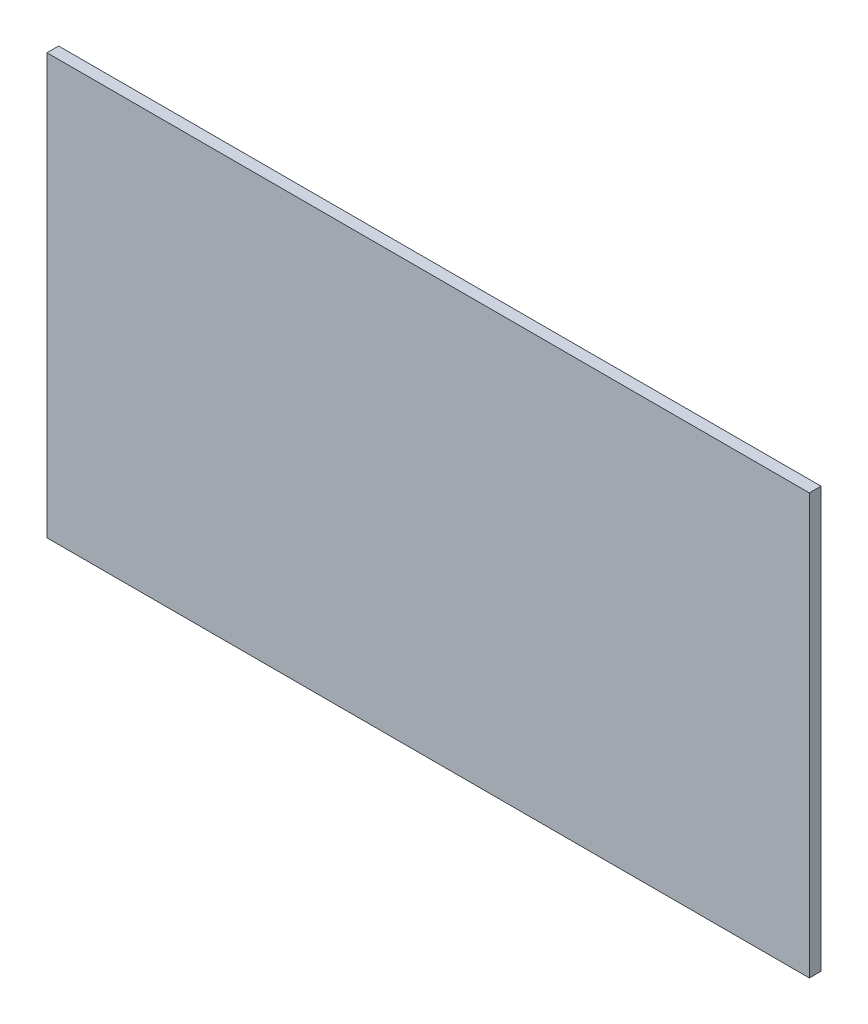
ISO-10303-21;
HEADER;
FILE_DESCRIPTION(('STEP AP214'),'2;1');
FILE_NAME('part.step','',(''),(''),'','','');
FILE_SCHEMA(('AUTOMOTIVE_DESIGN { 1 0 10303 214 1 1 1 1 }'));
ENDSEC;
DATA;
#1=APPLICATION_CONTEXT('core data for automotive mechanical design processes');
#2=APPLICATION_PROTOCOL_DEFINITION('international standard','automotive_design',2000,#1);
#3=PRODUCT_CONTEXT('',#1,'mechanical');
#4=PRODUCT('Part','Part','',(#3));
#5=PRODUCT_RELATED_PRODUCT_CATEGORY('part','',(#4));
#6=PRODUCT_DEFINITION_FORMATION('','',#4);
#7=PRODUCT_DEFINITION_CONTEXT('part definition',#1,'design');
#8=PRODUCT_DEFINITION('design','',#6,#7);
#9=PRODUCT_DEFINITION_SHAPE('','',#8);
#10=(LENGTH_UNIT() NAMED_UNIT(*) SI_UNIT(.MILLI.,.METRE.));
#11=(NAMED_UNIT(*) PLANE_ANGLE_UNIT() SI_UNIT($,.RADIAN.));
#12=(NAMED_UNIT(*) SI_UNIT($,.STERADIAN.) SOLID_ANGLE_UNIT());
#13=UNCERTAINTY_MEASURE_WITH_UNIT(LENGTH_MEASURE(1.E-05),#10,'distance_accuracy_value','');
#14=(GEOMETRIC_REPRESENTATION_CONTEXT(3) GLOBAL_UNCERTAINTY_ASSIGNED_CONTEXT((#13)) GLOBAL_UNIT_ASSIGNED_CONTEXT((#10,
#11,#12)) REPRESENTATION_CONTEXT('',''));
#15=CARTESIAN_POINT('',(0.,0.,0.));
#16=DIRECTION('',(0.,0.,1.));
#17=DIRECTION('',(1.,0.,0.));
#18=AXIS2_PLACEMENT_3D('',#15,#16,#17);
#19=CARTESIAN_POINT('',(0.,0.,3.));
#20=DIRECTION('',(1.,0.,0.));
#21=DIRECTION('',(0.,0.,-1.));
#22=AXIS2_PLACEMENT_3D('',#19,#20,#21);
#23=PLANE('',#22);
#24=DIRECTION('',(0.,-1.,0.));
#25=VECTOR('',#24,1.);
#26=CARTESIAN_POINT('',(0.,0.,0.));
#27=LINE('',#26,#25);
#28=CARTESIAN_POINT('',(0.,108.,0.));
#29=VERTEX_POINT('',#28);
#30=CARTESIAN_POINT('',(0.,0.,0.));
#31=VERTEX_POINT('',#30);
#32=EDGE_CURVE('E95',#29,#31,#27,.T.);
#33=ORIENTED_EDGE('',*,*,#32,.T.);
#34=DIRECTION('',(0.,0.,-1.));
#35=VECTOR('',#34,1.);
#36=CARTESIAN_POINT('',(0.,0.,3.));
#37=LINE('',#36,#35);
#38=CARTESIAN_POINT('',(0.,0.,3.));
#39=VERTEX_POINT('',#38);
#40=EDGE_CURVE('E11',#39,#31,#37,.T.);
#41=ORIENTED_EDGE('',*,*,#40,.F.);
#42=DIRECTION('',(0.,-1.,0.));
#43=VECTOR('',#42,1.);
#44=CARTESIAN_POINT('',(0.,0.,3.));
#45=LINE('',#44,#43);
#46=CARTESIAN_POINT('',(0.,108.,3.));
#47=VERTEX_POINT('',#46);
#48=EDGE_CURVE('E83',#47,#39,#45,.T.);
#49=ORIENTED_EDGE('',*,*,#48,.F.);
#50=DIRECTION('',(0.,0.,-1.));
#51=VECTOR('',#50,1.);
#52=CARTESIAN_POINT('',(0.,108.,3.));
#53=LINE('',#52,#51);
#54=EDGE_CURVE('E91',#47,#29,#53,.T.);
#55=ORIENTED_EDGE('',*,*,#54,.T.);
#56=EDGE_LOOP('',(#33,#41,#49,#55));
#57=FACE_BOUND('',#56,.T.);
#58=ADVANCED_FACE('F32',(#57),#23,.F.);
#59=CARTESIAN_POINT('',(0.,0.,3.));
#60=DIRECTION('',(0.,1.,0.));
#61=DIRECTION('',(0.,0.,1.));
#62=AXIS2_PLACEMENT_3D('',#59,#60,#61);
#63=PLANE('',#62);
#64=DIRECTION('',(1.,0.,0.));
#65=VECTOR('',#64,1.);
#66=CARTESIAN_POINT('',(0.,0.,0.));
#67=LINE('',#66,#65);
#68=CARTESIAN_POINT('',(196.,0.,0.));
#69=VERTEX_POINT('',#68);
#70=EDGE_CURVE('E87',#31,#69,#67,.T.);
#71=ORIENTED_EDGE('',*,*,#70,.T.);
#72=DIRECTION('',(0.,0.,-1.));
#73=VECTOR('',#72,1.);
#74=CARTESIAN_POINT('',(196.,0.,3.));
#75=LINE('',#74,#73);
#76=CARTESIAN_POINT('',(196.,0.,3.));
#77=VERTEX_POINT('',#76);
#78=EDGE_CURVE('E40',#77,#69,#75,.T.);
#79=ORIENTED_EDGE('',*,*,#78,.F.);
#80=DIRECTION('',(1.,0.,0.));
#81=VECTOR('',#80,1.);
#82=CARTESIAN_POINT('',(0.,0.,3.));
#83=LINE('',#82,#81);
#84=EDGE_CURVE('E78',#39,#77,#83,.T.);
#85=ORIENTED_EDGE('',*,*,#84,.F.);
#86=ORIENTED_EDGE('',*,*,#40,.T.);
#87=EDGE_LOOP('',(#71,#79,#85,#86));
#88=FACE_BOUND('',#87,.T.);
#89=ADVANCED_FACE('F86',(#88),#63,.F.);
#90=CARTESIAN_POINT('',(196.,0.,3.));
#91=DIRECTION('',(-1.,0.,0.));
#92=DIRECTION('',(0.,0.,1.));
#93=AXIS2_PLACEMENT_3D('',#90,#91,#92);
#94=PLANE('',#93);
#95=DIRECTION('',(0.,1.,0.));
#96=VECTOR('',#95,1.);
#97=CARTESIAN_POINT('',(196.,0.,0.));
#98=LINE('',#97,#96);
#99=CARTESIAN_POINT('',(196.,108.,0.));
#100=VERTEX_POINT('',#99);
#101=EDGE_CURVE('E65',#69,#100,#98,.T.);
#102=ORIENTED_EDGE('',*,*,#101,.T.);
#103=DIRECTION('',(0.,0.,-1.));
#104=VECTOR('',#103,1.);
#105=CARTESIAN_POINT('',(196.,108.,3.));
#106=LINE('',#105,#104);
#107=CARTESIAN_POINT('',(196.,108.,3.));
#108=VERTEX_POINT('',#107);
#109=EDGE_CURVE('E88',#108,#100,#106,.T.);
#110=ORIENTED_EDGE('',*,*,#109,.F.);
#111=DIRECTION('',(0.,1.,0.));
#112=VECTOR('',#111,1.);
#113=CARTESIAN_POINT('',(196.,0.,3.));
#114=LINE('',#113,#112);
#115=EDGE_CURVE('E81',#77,#108,#114,.T.);
#116=ORIENTED_EDGE('',*,*,#115,.F.);
#117=ORIENTED_EDGE('',*,*,#78,.T.);
#118=EDGE_LOOP('',(#102,#110,#116,#117));
#119=FACE_BOUND('',#118,.T.);
#120=ADVANCED_FACE('F89',(#119),#94,.F.);
#121=CARTESIAN_POINT('',(0.,108.,3.));
#122=DIRECTION('',(0.,-1.,0.));
#123=DIRECTION('',(0.,0.,-1.));
#124=AXIS2_PLACEMENT_3D('',#121,#122,#123);
#125=PLANE('',#124);
#126=DIRECTION('',(-1.,0.,0.));
#127=VECTOR('',#126,1.);
#128=CARTESIAN_POINT('',(0.,108.,0.));
#129=LINE('',#128,#127);
#130=EDGE_CURVE('E71',#100,#29,#129,.T.);
#131=ORIENTED_EDGE('',*,*,#130,.T.);
#132=ORIENTED_EDGE('',*,*,#54,.F.);
#133=DIRECTION('',(-1.,0.,0.));
#134=VECTOR('',#133,1.);
#135=CARTESIAN_POINT('',(0.,108.,3.));
#136=LINE('',#135,#134);
#137=EDGE_CURVE('E48',#108,#47,#136,.T.);
#138=ORIENTED_EDGE('',*,*,#137,.F.);
#139=ORIENTED_EDGE('',*,*,#109,.T.);
#140=EDGE_LOOP('',(#131,#132,#138,#139));
#141=FACE_BOUND('',#140,.T.);
#142=ADVANCED_FACE('F102',(#141),#125,.F.);
#143=CARTESIAN_POINT('',(0.,0.,3.));
#144=DIRECTION('',(0.,0.,-1.));
#145=DIRECTION('',(-1.,0.,0.));
#146=AXIS2_PLACEMENT_3D('',#143,#144,#145);
#147=PLANE('',#146);
#148=ORIENTED_EDGE('',*,*,#48,.T.);
#149=ORIENTED_EDGE('',*,*,#84,.T.);
#150=ORIENTED_EDGE('',*,*,#115,.T.);
#151=ORIENTED_EDGE('',*,*,#137,.T.);
#152=EDGE_LOOP('',(#148,#149,#150,#151));
#153=FACE_BOUND('',#152,.T.);
#154=ADVANCED_FACE('F79',(#153),#147,.F.);
#155=CARTESIAN_POINT('',(0.,0.,0.));
#156=DIRECTION('',(0.,0.,-1.));
#157=DIRECTION('',(-1.,0.,0.));
#158=AXIS2_PLACEMENT_3D('',#155,#156,#157);
#159=PLANE('',#158);
#160=ORIENTED_EDGE('',*,*,#32,.F.);
#161=ORIENTED_EDGE('',*,*,#130,.F.);
#162=ORIENTED_EDGE('',*,*,#101,.F.);
#163=ORIENTED_EDGE('',*,*,#70,.F.);
#164=EDGE_LOOP('',(#160,#161,#162,#163));
#165=FACE_BOUND('',#164,.T.);
#166=ADVANCED_FACE('F105',(#165),#159,.T.);
#167=CLOSED_SHELL('',(#58,#89,#120,#142,#154,#166));
#168=MANIFOLD_SOLID_BREP('B2',#167);
#169=ADVANCED_BREP_SHAPE_REPRESENTATION('',(#18,#168),#14);
#170=SHAPE_DEFINITION_REPRESENTATION(#9,#169);
ENDSEC;
END-ISO-10303-21;
